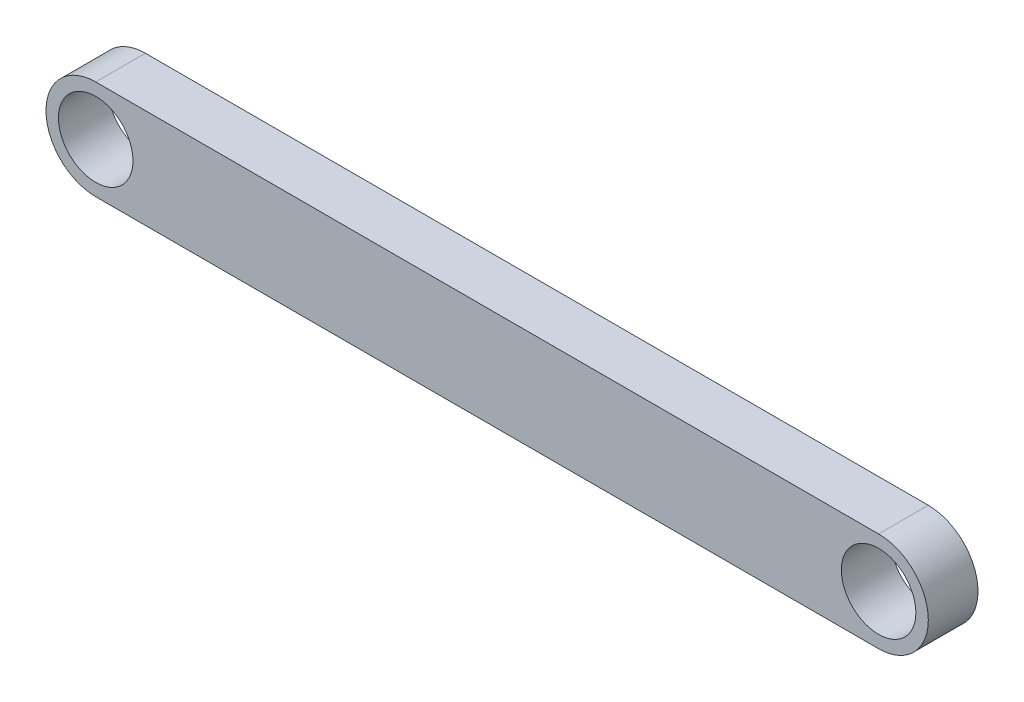
ISO-10303-21;
HEADER;
FILE_DESCRIPTION(('STEP AP214'),'2;1');
FILE_NAME('part.step','',(''),(''),'','','');
FILE_SCHEMA(('AUTOMOTIVE_DESIGN { 1 0 10303 214 1 1 1 1 }'));
ENDSEC;
DATA;
#1=APPLICATION_CONTEXT('core data for automotive mechanical design processes');
#2=APPLICATION_PROTOCOL_DEFINITION('international standard','automotive_design',2000,#1);
#3=PRODUCT_CONTEXT('',#1,'mechanical');
#4=PRODUCT('Part','Part','',(#3));
#5=PRODUCT_RELATED_PRODUCT_CATEGORY('part','',(#4));
#6=PRODUCT_DEFINITION_FORMATION('','',#4);
#7=PRODUCT_DEFINITION_CONTEXT('part definition',#1,'design');
#8=PRODUCT_DEFINITION('design','',#6,#7);
#9=PRODUCT_DEFINITION_SHAPE('','',#8);
#10=(LENGTH_UNIT() NAMED_UNIT(*) SI_UNIT(.MILLI.,.METRE.));
#11=(NAMED_UNIT(*) PLANE_ANGLE_UNIT() SI_UNIT($,.RADIAN.));
#12=(NAMED_UNIT(*) SI_UNIT($,.STERADIAN.) SOLID_ANGLE_UNIT());
#13=UNCERTAINTY_MEASURE_WITH_UNIT(LENGTH_MEASURE(1.E-05),#10,'distance_accuracy_value','');
#14=(GEOMETRIC_REPRESENTATION_CONTEXT(3) GLOBAL_UNCERTAINTY_ASSIGNED_CONTEXT((#13)) GLOBAL_UNIT_ASSIGNED_CONTEXT((#10,
#11,#12)) REPRESENTATION_CONTEXT('',''));
#15=CARTESIAN_POINT('',(0.,0.,0.));
#16=DIRECTION('',(0.,0.,1.));
#17=DIRECTION('',(1.,0.,0.));
#18=AXIS2_PLACEMENT_3D('',#15,#16,#17);
#19=CARTESIAN_POINT('',(157.5,0.,10.));
#20=DIRECTION('',(0.,0.,1.));
#21=DIRECTION('',(1.,0.,0.));
#22=AXIS2_PLACEMENT_3D('',#19,#20,#21);
#23=PLANE('',#22);
#24=CARTESIAN_POINT('',(-157.5,0.,10.));
#25=DIRECTION('',(0.,0.,1.));
#26=DIRECTION('',(1.,0.,0.));
#27=AXIS2_PLACEMENT_3D('',#24,#25,#26);
#28=CIRCLE('',#27,15.);
#29=CARTESIAN_POINT('',(-142.5,0.,10.));
#30=VERTEX_POINT('',#29);
#31=EDGE_CURVE('E100',#30,#30,#28,.T.);
#32=ORIENTED_EDGE('',*,*,#31,.F.);
#33=EDGE_LOOP('',(#32));
#34=FACE_BOUND('',#33,.T.);
#35=CARTESIAN_POINT('',(157.5,0.,10.));
#36=DIRECTION('',(0.,0.,1.));
#37=DIRECTION('',(1.,0.,0.));
#38=AXIS2_PLACEMENT_3D('',#35,#36,#37);
#39=CIRCLE('',#38,20.);
#40=CARTESIAN_POINT('',(157.5,-20.,10.));
#41=VERTEX_POINT('',#40);
#42=CARTESIAN_POINT('',(157.5,20.,10.));
#43=VERTEX_POINT('',#42);
#44=EDGE_CURVE('E85',#41,#43,#39,.T.);
#45=ORIENTED_EDGE('',*,*,#44,.T.);
#46=DIRECTION('',(-1.,0.,0.));
#47=VECTOR('',#46,1.);
#48=CARTESIAN_POINT('',(157.5,20.,10.));
#49=LINE('',#48,#47);
#50=CARTESIAN_POINT('',(-157.5,20.,10.));
#51=VERTEX_POINT('',#50);
#52=EDGE_CURVE('E80',#43,#51,#49,.T.);
#53=ORIENTED_EDGE('',*,*,#52,.T.);
#54=CARTESIAN_POINT('',(-157.5,0.,10.));
#55=DIRECTION('',(0.,0.,1.));
#56=DIRECTION('',(-1.,0.,0.));
#57=AXIS2_PLACEMENT_3D('',#54,#55,#56);
#58=CIRCLE('',#57,20.);
#59=CARTESIAN_POINT('',(-157.5,-20.,10.));
#60=VERTEX_POINT('',#59);
#61=EDGE_CURVE('E83',#51,#60,#58,.T.);
#62=ORIENTED_EDGE('',*,*,#61,.T.);
#63=DIRECTION('',(1.,0.,0.));
#64=VECTOR('',#63,1.);
#65=CARTESIAN_POINT('',(157.5,-20.,10.));
#66=LINE('',#65,#64);
#67=EDGE_CURVE('E50',#60,#41,#66,.T.);
#68=ORIENTED_EDGE('',*,*,#67,.T.);
#69=EDGE_LOOP('',(#45,#53,#62,#68));
#70=FACE_BOUND('',#69,.T.);
#71=CARTESIAN_POINT('',(157.5,0.,10.));
#72=DIRECTION('',(0.,0.,1.));
#73=DIRECTION('',(1.,0.,0.));
#74=AXIS2_PLACEMENT_3D('',#71,#72,#73);
#75=CIRCLE('',#74,15.);
#76=CARTESIAN_POINT('',(172.5,0.,10.));
#77=VERTEX_POINT('',#76);
#78=EDGE_CURVE('E115',#77,#77,#75,.T.);
#79=ORIENTED_EDGE('',*,*,#78,.F.);
#80=EDGE_LOOP('',(#79));
#81=FACE_BOUND('',#80,.T.);
#82=ADVANCED_FACE('F33',(#34,#70,#81),#23,.T.);
#83=CARTESIAN_POINT('',(157.5,0.,-10.));
#84=DIRECTION('',(0.,0.,1.));
#85=DIRECTION('',(1.,0.,0.));
#86=AXIS2_PLACEMENT_3D('',#83,#84,#85);
#87=PLANE('',#86);
#88=CARTESIAN_POINT('',(-157.5,0.,-10.));
#89=DIRECTION('',(0.,0.,1.));
#90=DIRECTION('',(1.,0.,0.));
#91=AXIS2_PLACEMENT_3D('',#88,#89,#90);
#92=CIRCLE('',#91,15.);
#93=CARTESIAN_POINT('',(-142.5,0.,-10.));
#94=VERTEX_POINT('',#93);
#95=EDGE_CURVE('E112',#94,#94,#92,.T.);
#96=ORIENTED_EDGE('',*,*,#95,.T.);
#97=EDGE_LOOP('',(#96));
#98=FACE_BOUND('',#97,.T.);
#99=CARTESIAN_POINT('',(157.5,0.,-10.));
#100=DIRECTION('',(0.,0.,1.));
#101=DIRECTION('',(1.,0.,0.));
#102=AXIS2_PLACEMENT_3D('',#99,#100,#101);
#103=CIRCLE('',#102,20.);
#104=CARTESIAN_POINT('',(157.5,-20.,-10.));
#105=VERTEX_POINT('',#104);
#106=CARTESIAN_POINT('',(157.5,20.,-10.));
#107=VERTEX_POINT('',#106);
#108=EDGE_CURVE('E97',#105,#107,#103,.T.);
#109=ORIENTED_EDGE('',*,*,#108,.F.);
#110=DIRECTION('',(1.,0.,0.));
#111=VECTOR('',#110,1.);
#112=CARTESIAN_POINT('',(157.5,-20.,-10.));
#113=LINE('',#112,#111);
#114=CARTESIAN_POINT('',(-157.5,-20.,-10.));
#115=VERTEX_POINT('',#114);
#116=EDGE_CURVE('E73',#115,#105,#113,.T.);
#117=ORIENTED_EDGE('',*,*,#116,.F.);
#118=CARTESIAN_POINT('',(-157.5,0.,-10.));
#119=DIRECTION('',(0.,0.,1.));
#120=DIRECTION('',(-1.,0.,0.));
#121=AXIS2_PLACEMENT_3D('',#118,#119,#120);
#122=CIRCLE('',#121,20.);
#123=CARTESIAN_POINT('',(-157.5,20.,-10.));
#124=VERTEX_POINT('',#123);
#125=EDGE_CURVE('E67',#124,#115,#122,.T.);
#126=ORIENTED_EDGE('',*,*,#125,.F.);
#127=DIRECTION('',(-1.,0.,0.));
#128=VECTOR('',#127,1.);
#129=CARTESIAN_POINT('',(157.5,20.,-10.));
#130=LINE('',#129,#128);
#131=EDGE_CURVE('E89',#107,#124,#130,.T.);
#132=ORIENTED_EDGE('',*,*,#131,.F.);
#133=EDGE_LOOP('',(#109,#117,#126,#132));
#134=FACE_BOUND('',#133,.T.);
#135=CARTESIAN_POINT('',(157.5,0.,-10.));
#136=DIRECTION('',(0.,0.,1.));
#137=DIRECTION('',(1.,0.,0.));
#138=AXIS2_PLACEMENT_3D('',#135,#136,#137);
#139=CIRCLE('',#138,15.);
#140=CARTESIAN_POINT('',(172.5,0.,-10.));
#141=VERTEX_POINT('',#140);
#142=EDGE_CURVE('E118',#141,#141,#139,.T.);
#143=ORIENTED_EDGE('',*,*,#142,.T.);
#144=EDGE_LOOP('',(#143));
#145=FACE_BOUND('',#144,.T.);
#146=ADVANCED_FACE('F108',(#98,#134,#145),#87,.F.);
#147=CARTESIAN_POINT('',(157.5,0.,10.));
#148=DIRECTION('',(0.,0.,-1.));
#149=DIRECTION('',(-1.,0.,0.));
#150=AXIS2_PLACEMENT_3D('',#147,#148,#149);
#151=CYLINDRICAL_SURFACE('',#150,20.);
#152=ORIENTED_EDGE('',*,*,#108,.T.);
#153=DIRECTION('',(0.,0.,-1.));
#154=VECTOR('',#153,1.);
#155=CARTESIAN_POINT('',(157.5,20.,10.));
#156=LINE('',#155,#154);
#157=EDGE_CURVE('E11',#43,#107,#156,.T.);
#158=ORIENTED_EDGE('',*,*,#157,.F.);
#159=ORIENTED_EDGE('',*,*,#44,.F.);
#160=DIRECTION('',(0.,0.,-1.));
#161=VECTOR('',#160,1.);
#162=CARTESIAN_POINT('',(157.5,-20.,10.));
#163=LINE('',#162,#161);
#164=EDGE_CURVE('E93',#41,#105,#163,.T.);
#165=ORIENTED_EDGE('',*,*,#164,.T.);
#166=EDGE_LOOP('',(#152,#158,#159,#165));
#167=FACE_BOUND('',#166,.T.);
#168=ADVANCED_FACE('F35',(#167),#151,.T.);
#169=CARTESIAN_POINT('',(157.5,20.,10.));
#170=DIRECTION('',(0.,-1.,0.));
#171=DIRECTION('',(0.,0.,-1.));
#172=AXIS2_PLACEMENT_3D('',#169,#170,#171);
#173=PLANE('',#172);
#174=ORIENTED_EDGE('',*,*,#131,.T.);
#175=DIRECTION('',(0.,0.,-1.));
#176=VECTOR('',#175,1.);
#177=CARTESIAN_POINT('',(-157.5,20.,10.));
#178=LINE('',#177,#176);
#179=EDGE_CURVE('E42',#51,#124,#178,.T.);
#180=ORIENTED_EDGE('',*,*,#179,.F.);
#181=ORIENTED_EDGE('',*,*,#52,.F.);
#182=ORIENTED_EDGE('',*,*,#157,.T.);
#183=EDGE_LOOP('',(#174,#180,#181,#182));
#184=FACE_BOUND('',#183,.T.);
#185=ADVANCED_FACE('F88',(#184),#173,.F.);
#186=CARTESIAN_POINT('',(-157.5,0.,10.));
#187=DIRECTION('',(0.,0.,-1.));
#188=DIRECTION('',(-1.,0.,0.));
#189=AXIS2_PLACEMENT_3D('',#186,#187,#188);
#190=CYLINDRICAL_SURFACE('',#189,20.);
#191=ORIENTED_EDGE('',*,*,#125,.T.);
#192=DIRECTION('',(0.,0.,-1.));
#193=VECTOR('',#192,1.);
#194=CARTESIAN_POINT('',(-157.5,-20.,10.));
#195=LINE('',#194,#193);
#196=EDGE_CURVE('E90',#60,#115,#195,.T.);
#197=ORIENTED_EDGE('',*,*,#196,.F.);
#198=ORIENTED_EDGE('',*,*,#61,.F.);
#199=ORIENTED_EDGE('',*,*,#179,.T.);
#200=EDGE_LOOP('',(#191,#197,#198,#199));
#201=FACE_BOUND('',#200,.T.);
#202=ADVANCED_FACE('F91',(#201),#190,.T.);
#203=CARTESIAN_POINT('',(157.5,-20.,10.));
#204=DIRECTION('',(0.,1.,0.));
#205=DIRECTION('',(0.,0.,1.));
#206=AXIS2_PLACEMENT_3D('',#203,#204,#205);
#207=PLANE('',#206);
#208=ORIENTED_EDGE('',*,*,#116,.T.);
#209=ORIENTED_EDGE('',*,*,#164,.F.);
#210=ORIENTED_EDGE('',*,*,#67,.F.);
#211=ORIENTED_EDGE('',*,*,#196,.T.);
#212=EDGE_LOOP('',(#208,#209,#210,#211));
#213=FACE_BOUND('',#212,.T.);
#214=ADVANCED_FACE('F105',(#213),#207,.F.);
#215=CARTESIAN_POINT('',(-157.5,0.,10.));
#216=DIRECTION('',(0.,0.,-1.));
#217=DIRECTION('',(-1.,0.,0.));
#218=AXIS2_PLACEMENT_3D('',#215,#216,#217);
#219=CYLINDRICAL_SURFACE('',#218,15.);
#220=ORIENTED_EDGE('',*,*,#31,.T.);
#221=EDGE_LOOP('',(#220));
#222=FACE_BOUND('',#221,.T.);
#223=ORIENTED_EDGE('',*,*,#95,.F.);
#224=EDGE_LOOP('',(#223));
#225=FACE_BOUND('',#224,.T.);
#226=ADVANCED_FACE('F136',(#222,#225),#219,.F.);
#227=CARTESIAN_POINT('',(157.5,0.,10.));
#228=DIRECTION('',(0.,0.,-1.));
#229=DIRECTION('',(-1.,0.,0.));
#230=AXIS2_PLACEMENT_3D('',#227,#228,#229);
#231=CYLINDRICAL_SURFACE('',#230,15.);
#232=ORIENTED_EDGE('',*,*,#78,.T.);
#233=EDGE_LOOP('',(#232));
#234=FACE_BOUND('',#233,.T.);
#235=ORIENTED_EDGE('',*,*,#142,.F.);
#236=EDGE_LOOP('',(#235));
#237=FACE_BOUND('',#236,.T.);
#238=ADVANCED_FACE('F124',(#234,#237),#231,.F.);
#239=CLOSED_SHELL('',(#82,#146,#168,#185,#202,#214,#226,#238));
#240=MANIFOLD_SOLID_BREP('B2',#239);
#241=ADVANCED_BREP_SHAPE_REPRESENTATION('',(#18,#240),#14);
#242=SHAPE_DEFINITION_REPRESENTATION(#9,#241);
ENDSEC;
END-ISO-10303-21;
